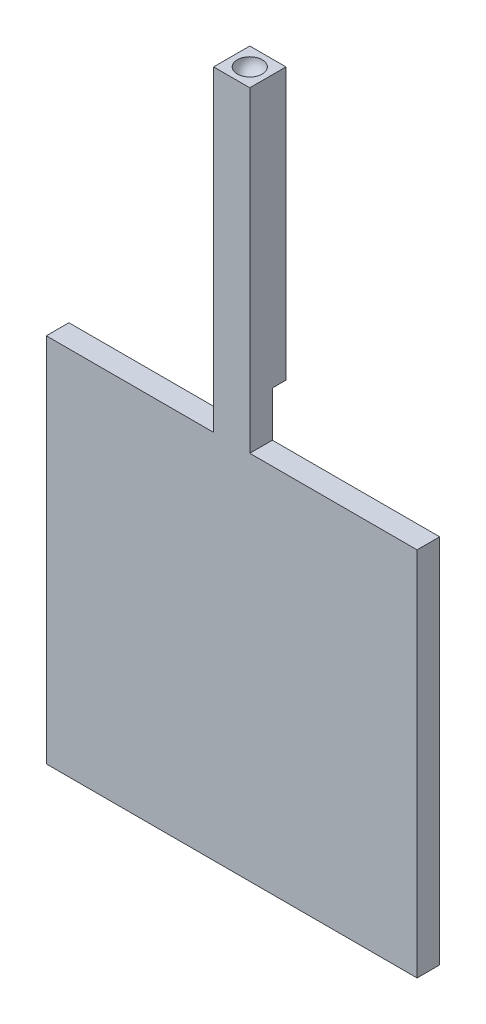
ISO-10303-21;
HEADER;
FILE_DESCRIPTION(('STEP AP214'),'2;1');
FILE_NAME('part.step','',(''),(''),'','','');
FILE_SCHEMA(('AUTOMOTIVE_DESIGN { 1 0 10303 214 1 1 1 1 }'));
ENDSEC;
DATA;
#1=APPLICATION_CONTEXT('core data for automotive mechanical design processes');
#2=APPLICATION_PROTOCOL_DEFINITION('international standard','automotive_design',2000,#1);
#3=PRODUCT_CONTEXT('',#1,'mechanical');
#4=PRODUCT('Part','Part','',(#3));
#5=PRODUCT_RELATED_PRODUCT_CATEGORY('part','',(#4));
#6=PRODUCT_DEFINITION_FORMATION('','',#4);
#7=PRODUCT_DEFINITION_CONTEXT('part definition',#1,'design');
#8=PRODUCT_DEFINITION('design','',#6,#7);
#9=PRODUCT_DEFINITION_SHAPE('','',#8);
#10=(LENGTH_UNIT() NAMED_UNIT(*) SI_UNIT(.MILLI.,.METRE.));
#11=(NAMED_UNIT(*) PLANE_ANGLE_UNIT() SI_UNIT($,.RADIAN.));
#12=(NAMED_UNIT(*) SI_UNIT($,.STERADIAN.) SOLID_ANGLE_UNIT());
#13=UNCERTAINTY_MEASURE_WITH_UNIT(LENGTH_MEASURE(1.E-05),#10,'distance_accuracy_value','');
#14=(GEOMETRIC_REPRESENTATION_CONTEXT(3) GLOBAL_UNCERTAINTY_ASSIGNED_CONTEXT((#13)) GLOBAL_UNIT_ASSIGNED_CONTEXT((#10,
#11,#12)) REPRESENTATION_CONTEXT('',''));
#15=CARTESIAN_POINT('',(0.,0.,0.));
#16=DIRECTION('',(0.,0.,1.));
#17=DIRECTION('',(1.,0.,0.));
#18=AXIS2_PLACEMENT_3D('',#15,#16,#17);
#19=CARTESIAN_POINT('',(0.,0.,0.));
#20=DIRECTION('',(0.,0.,-1.));
#21=DIRECTION('',(-1.,0.,0.));
#22=AXIS2_PLACEMENT_3D('',#19,#20,#21);
#23=PLANE('',#22);
#24=DIRECTION('',(0.,-1.,0.));
#25=VECTOR('',#24,1.);
#26=CARTESIAN_POINT('',(0.,0.,0.));
#27=LINE('',#26,#25);
#28=CARTESIAN_POINT('',(0.,82.,0.));
#29=VERTEX_POINT('',#28);
#30=CARTESIAN_POINT('',(0.,0.,0.));
#31=VERTEX_POINT('',#30);
#32=EDGE_CURVE('E187',#29,#31,#27,.T.);
#33=ORIENTED_EDGE('',*,*,#32,.F.);
#34=DIRECTION('',(-1.,0.,0.));
#35=VECTOR('',#34,1.);
#36=CARTESIAN_POINT('',(0.,82.,0.));
#37=LINE('',#36,#35);
#38=CARTESIAN_POINT('',(37.,82.,0.));
#39=VERTEX_POINT('',#38);
#40=EDGE_CURVE('E206',#39,#29,#37,.T.);
#41=ORIENTED_EDGE('',*,*,#40,.F.);
#42=DIRECTION('',(0.,-1.,0.));
#43=VECTOR('',#42,1.);
#44=CARTESIAN_POINT('',(37.,92.,0.));
#45=LINE('',#44,#43);
#46=CARTESIAN_POINT('',(37.,92.,0.));
#47=VERTEX_POINT('',#46);
#48=EDGE_CURVE('E181',#47,#39,#45,.T.);
#49=ORIENTED_EDGE('',*,*,#48,.F.);
#50=DIRECTION('',(-1.,0.,0.));
#51=VECTOR('',#50,1.);
#52=CARTESIAN_POINT('',(37.,92.,0.));
#53=LINE('',#52,#51);
#54=CARTESIAN_POINT('',(45.,92.,0.));
#55=VERTEX_POINT('',#54);
#56=EDGE_CURVE('E168',#55,#47,#53,.T.);
#57=ORIENTED_EDGE('',*,*,#56,.F.);
#58=DIRECTION('',(0.,-1.,0.));
#59=VECTOR('',#58,1.);
#60=CARTESIAN_POINT('',(45.,92.,0.));
#61=LINE('',#60,#59);
#62=CARTESIAN_POINT('',(45.,82.,0.));
#63=VERTEX_POINT('',#62);
#64=EDGE_CURVE('E184',#55,#63,#61,.T.);
#65=ORIENTED_EDGE('',*,*,#64,.T.);
#66=CARTESIAN_POINT('',(82.,82.,0.));
#67=VERTEX_POINT('',#66);
#68=EDGE_CURVE('E192',#67,#63,#37,.T.);
#69=ORIENTED_EDGE('',*,*,#68,.F.);
#70=DIRECTION('',(0.,1.,0.));
#71=VECTOR('',#70,1.);
#72=CARTESIAN_POINT('',(82.,0.,0.));
#73=LINE('',#72,#71);
#74=CARTESIAN_POINT('',(82.,0.,0.));
#75=VERTEX_POINT('',#74);
#76=EDGE_CURVE('E204',#75,#67,#73,.T.);
#77=ORIENTED_EDGE('',*,*,#76,.F.);
#78=DIRECTION('',(1.,0.,0.));
#79=VECTOR('',#78,1.);
#80=CARTESIAN_POINT('',(0.,0.,0.));
#81=LINE('',#80,#79);
#82=EDGE_CURVE('E202',#31,#75,#81,.T.);
#83=ORIENTED_EDGE('',*,*,#82,.F.);
#84=EDGE_LOOP('',(#33,#41,#49,#57,#65,#69,#77,#83));
#85=FACE_BOUND('',#84,.T.);
#86=DIRECTION('',(-1.,0.,0.));
#87=VECTOR('',#86,1.);
#88=CARTESIAN_POINT('',(37.5,15.,0.));
#89=LINE('',#88,#87);
#90=CARTESIAN_POINT('',(44.5,15.,0.));
#91=VERTEX_POINT('',#90);
#92=CARTESIAN_POINT('',(37.5,15.,0.));
#93=VERTEX_POINT('',#92);
#94=EDGE_CURVE('E48',#91,#93,#89,.T.);
#95=ORIENTED_EDGE('',*,*,#94,.F.);
#96=DIRECTION('',(0.,1.,0.));
#97=VECTOR('',#96,1.);
#98=CARTESIAN_POINT('',(44.5,65.,1.74574066942157E-13));
#99=LINE('',#98,#97);
#100=CARTESIAN_POINT('',(44.5,65.,1.74574066942157E-13));
#101=VERTEX_POINT('',#100);
#102=EDGE_CURVE('E123',#91,#101,#99,.T.);
#103=ORIENTED_EDGE('',*,*,#102,.T.);
#104=DIRECTION('',(-1.,0.,0.));
#105=VECTOR('',#104,1.);
#106=CARTESIAN_POINT('',(37.5,65.,1.74574066942157E-13));
#107=LINE('',#106,#105);
#108=CARTESIAN_POINT('',(37.5,65.,1.74574066942157E-13));
#109=VERTEX_POINT('',#108);
#110=EDGE_CURVE('E129',#101,#109,#107,.T.);
#111=ORIENTED_EDGE('',*,*,#110,.T.);
#112=DIRECTION('',(0.,-1.,0.));
#113=VECTOR('',#112,1.);
#114=CARTESIAN_POINT('',(37.5,65.,1.74574066942157E-13));
#115=LINE('',#114,#113);
#116=EDGE_CURVE('E137',#109,#93,#115,.T.);
#117=ORIENTED_EDGE('',*,*,#116,.T.);
#118=EDGE_LOOP('',(#95,#103,#111,#117));
#119=FACE_BOUND('',#118,.T.);
#120=ADVANCED_FACE('F33',(#85,#119),#23,.T.);
#121=CARTESIAN_POINT('',(0.,82.,5.));
#122=DIRECTION('',(0.,-1.,0.));
#123=DIRECTION('',(0.,0.,-1.));
#124=AXIS2_PLACEMENT_3D('',#121,#122,#123);
#125=PLANE('',#124);
#126=DIRECTION('',(0.,0.,-1.));
#127=VECTOR('',#126,1.);
#128=CARTESIAN_POINT('',(45.,82.,0.));
#129=LINE('',#128,#127);
#130=CARTESIAN_POINT('',(45.,82.,5.));
#131=VERTEX_POINT('',#130);
#132=EDGE_CURVE('E56',#131,#63,#129,.T.);
#133=ORIENTED_EDGE('',*,*,#132,.F.);
#134=DIRECTION('',(-1.,0.,0.));
#135=VECTOR('',#134,1.);
#136=CARTESIAN_POINT('',(0.,82.,5.));
#137=LINE('',#136,#135);
#138=CARTESIAN_POINT('',(82.,82.,5.));
#139=VERTEX_POINT('',#138);
#140=EDGE_CURVE('E197',#139,#131,#137,.T.);
#141=ORIENTED_EDGE('',*,*,#140,.F.);
#142=DIRECTION('',(0.,0.,-1.));
#143=VECTOR('',#142,1.);
#144=CARTESIAN_POINT('',(82.,82.,5.));
#145=LINE('',#144,#143);
#146=EDGE_CURVE('E210',#139,#67,#145,.T.);
#147=ORIENTED_EDGE('',*,*,#146,.T.);
#148=ORIENTED_EDGE('',*,*,#68,.T.);
#149=EDGE_LOOP('',(#133,#141,#147,#148));
#150=FACE_BOUND('',#149,.T.);
#151=ADVANCED_FACE('F224',(#150),#125,.F.);
#152=DIRECTION('',(0.,0.,1.));
#153=VECTOR('',#152,1.);
#154=CARTESIAN_POINT('',(37.,82.,0.));
#155=LINE('',#154,#153);
#156=CARTESIAN_POINT('',(37.,82.,5.));
#157=VERTEX_POINT('',#156);
#158=EDGE_CURVE('E172',#39,#157,#155,.T.);
#159=ORIENTED_EDGE('',*,*,#158,.F.);
#160=ORIENTED_EDGE('',*,*,#40,.T.);
#161=DIRECTION('',(0.,0.,-1.));
#162=VECTOR('',#161,1.);
#163=CARTESIAN_POINT('',(0.,82.,5.));
#164=LINE('',#163,#162);
#165=CARTESIAN_POINT('',(0.,82.,5.));
#166=VERTEX_POINT('',#165);
#167=EDGE_CURVE('E199',#166,#29,#164,.T.);
#168=ORIENTED_EDGE('',*,*,#167,.F.);
#169=EDGE_CURVE('E196',#157,#166,#137,.T.);
#170=ORIENTED_EDGE('',*,*,#169,.F.);
#171=EDGE_LOOP('',(#159,#160,#168,#170));
#172=FACE_BOUND('',#171,.T.);
#173=ADVANCED_FACE('F242',(#172),#125,.F.);
#174=CARTESIAN_POINT('',(0.,0.,5.));
#175=DIRECTION('',(1.,0.,0.));
#176=DIRECTION('',(0.,1.,0.));
#177=AXIS2_PLACEMENT_3D('',#174,#175,#176);
#178=PLANE('',#177);
#179=ORIENTED_EDGE('',*,*,#32,.T.);
#180=DIRECTION('',(0.,0.,-1.));
#181=VECTOR('',#180,1.);
#182=CARTESIAN_POINT('',(0.,0.,5.));
#183=LINE('',#182,#181);
#184=CARTESIAN_POINT('',(0.,0.,5.));
#185=VERTEX_POINT('',#184);
#186=EDGE_CURVE('E11',#185,#31,#183,.T.);
#187=ORIENTED_EDGE('',*,*,#186,.F.);
#188=DIRECTION('',(0.,-1.,0.));
#189=VECTOR('',#188,1.);
#190=CARTESIAN_POINT('',(0.,0.,5.));
#191=LINE('',#190,#189);
#192=EDGE_CURVE('E188',#166,#185,#191,.T.);
#193=ORIENTED_EDGE('',*,*,#192,.F.);
#194=ORIENTED_EDGE('',*,*,#167,.T.);
#195=EDGE_LOOP('',(#179,#187,#193,#194));
#196=FACE_BOUND('',#195,.T.);
#197=ADVANCED_FACE('F35',(#196),#178,.F.);
#198=CARTESIAN_POINT('',(0.,0.,5.));
#199=DIRECTION('',(0.,1.,0.));
#200=DIRECTION('',(0.,0.,1.));
#201=AXIS2_PLACEMENT_3D('',#198,#199,#200);
#202=PLANE('',#201);
#203=ORIENTED_EDGE('',*,*,#82,.T.);
#204=DIRECTION('',(0.,0.,-1.));
#205=VECTOR('',#204,1.);
#206=CARTESIAN_POINT('',(82.,0.,5.));
#207=LINE('',#206,#205);
#208=CARTESIAN_POINT('',(82.,0.,5.));
#209=VERTEX_POINT('',#208);
#210=EDGE_CURVE('E41',#209,#75,#207,.T.);
#211=ORIENTED_EDGE('',*,*,#210,.F.);
#212=DIRECTION('',(1.,0.,0.));
#213=VECTOR('',#212,1.);
#214=CARTESIAN_POINT('',(0.,0.,5.));
#215=LINE('',#214,#213);
#216=EDGE_CURVE('E191',#185,#209,#215,.T.);
#217=ORIENTED_EDGE('',*,*,#216,.F.);
#218=ORIENTED_EDGE('',*,*,#186,.T.);
#219=EDGE_LOOP('',(#203,#211,#217,#218));
#220=FACE_BOUND('',#219,.T.);
#221=ADVANCED_FACE('F246',(#220),#202,.F.);
#222=CARTESIAN_POINT('',(82.,0.,5.));
#223=DIRECTION('',(-1.,0.,0.));
#224=DIRECTION('',(0.,-1.,0.));
#225=AXIS2_PLACEMENT_3D('',#222,#223,#224);
#226=PLANE('',#225);
#227=ORIENTED_EDGE('',*,*,#76,.T.);
#228=ORIENTED_EDGE('',*,*,#146,.F.);
#229=DIRECTION('',(0.,1.,0.));
#230=VECTOR('',#229,1.);
#231=CARTESIAN_POINT('',(82.,0.,5.));
#232=LINE('',#231,#230);
#233=EDGE_CURVE('E194',#209,#139,#232,.T.);
#234=ORIENTED_EDGE('',*,*,#233,.F.);
#235=ORIENTED_EDGE('',*,*,#210,.T.);
#236=EDGE_LOOP('',(#227,#228,#234,#235));
#237=FACE_BOUND('',#236,.T.);
#238=ADVANCED_FACE('F217',(#237),#226,.F.);
#239=CARTESIAN_POINT('',(0.,0.,5.));
#240=DIRECTION('',(0.,0.,-1.));
#241=DIRECTION('',(-1.,0.,0.));
#242=AXIS2_PLACEMENT_3D('',#239,#240,#241);
#243=PLANE('',#242);
#244=ORIENTED_EDGE('',*,*,#192,.T.);
#245=ORIENTED_EDGE('',*,*,#216,.T.);
#246=ORIENTED_EDGE('',*,*,#233,.T.);
#247=ORIENTED_EDGE('',*,*,#140,.T.);
#248=DIRECTION('',(0.,-1.,0.));
#249=VECTOR('',#248,1.);
#250=CARTESIAN_POINT('',(45.,92.,5.));
#251=LINE('',#250,#249);
#252=CARTESIAN_POINT('',(45.,152.,5.));
#253=VERTEX_POINT('',#252);
#254=EDGE_CURVE('E171',#253,#131,#251,.T.);
#255=ORIENTED_EDGE('',*,*,#254,.F.);
#256=DIRECTION('',(1.,0.,0.));
#257=VECTOR('',#256,1.);
#258=CARTESIAN_POINT('',(45.,152.,5.));
#259=LINE('',#258,#257);
#260=CARTESIAN_POINT('',(37.,152.,5.));
#261=VERTEX_POINT('',#260);
#262=EDGE_CURVE('E149',#261,#253,#259,.T.);
#263=ORIENTED_EDGE('',*,*,#262,.F.);
#264=DIRECTION('',(0.,-1.,0.));
#265=VECTOR('',#264,1.);
#266=CARTESIAN_POINT('',(37.,92.,5.));
#267=LINE('',#266,#265);
#268=EDGE_CURVE('E178',#261,#157,#267,.T.);
#269=ORIENTED_EDGE('',*,*,#268,.T.);
#270=ORIENTED_EDGE('',*,*,#169,.T.);
#271=EDGE_LOOP('',(#244,#245,#246,#247,#255,#263,#269,#270));
#272=FACE_BOUND('',#271,.T.);
#273=ADVANCED_FACE('F226',(#272),#243,.F.);
#274=CARTESIAN_POINT('',(45.,92.,0.));
#275=DIRECTION('',(-1.,0.,0.));
#276=DIRECTION('',(0.,0.,1.));
#277=AXIS2_PLACEMENT_3D('',#274,#275,#276);
#278=PLANE('',#277);
#279=ORIENTED_EDGE('',*,*,#132,.T.);
#280=ORIENTED_EDGE('',*,*,#64,.F.);
#281=DIRECTION('',(0.,0.,-1.));
#282=VECTOR('',#281,1.);
#283=CARTESIAN_POINT('',(45.,92.,-3.));
#284=LINE('',#283,#282);
#285=CARTESIAN_POINT('',(45.,92.,-3.));
#286=VERTEX_POINT('',#285);
#287=EDGE_CURVE('E160',#55,#286,#284,.T.);
#288=ORIENTED_EDGE('',*,*,#287,.T.);
#289=DIRECTION('',(0.,-1.,0.));
#290=VECTOR('',#289,1.);
#291=CARTESIAN_POINT('',(45.,152.,-3.));
#292=LINE('',#291,#290);
#293=CARTESIAN_POINT('',(45.,152.,-3.));
#294=VERTEX_POINT('',#293);
#295=EDGE_CURVE('E165',#294,#286,#292,.T.);
#296=ORIENTED_EDGE('',*,*,#295,.F.);
#297=DIRECTION('',(0.,0.,-1.));
#298=VECTOR('',#297,1.);
#299=CARTESIAN_POINT('',(45.,152.,-3.));
#300=LINE('',#299,#298);
#301=EDGE_CURVE('E153',#253,#294,#300,.T.);
#302=ORIENTED_EDGE('',*,*,#301,.F.);
#303=ORIENTED_EDGE('',*,*,#254,.T.);
#304=EDGE_LOOP('',(#279,#280,#288,#296,#302,#303));
#305=FACE_BOUND('',#304,.T.);
#306=ADVANCED_FACE('F230',(#305),#278,.F.);
#307=CARTESIAN_POINT('',(37.,92.,0.));
#308=DIRECTION('',(1.,0.,0.));
#309=DIRECTION('',(0.,0.,-1.));
#310=AXIS2_PLACEMENT_3D('',#307,#308,#309);
#311=PLANE('',#310);
#312=ORIENTED_EDGE('',*,*,#158,.T.);
#313=ORIENTED_EDGE('',*,*,#268,.F.);
#314=DIRECTION('',(0.,0.,1.));
#315=VECTOR('',#314,1.);
#316=CARTESIAN_POINT('',(37.,152.,-3.));
#317=LINE('',#316,#315);
#318=CARTESIAN_POINT('',(37.,152.,-3.));
#319=VERTEX_POINT('',#318);
#320=EDGE_CURVE('E146',#319,#261,#317,.T.);
#321=ORIENTED_EDGE('',*,*,#320,.F.);
#322=DIRECTION('',(0.,-1.,0.));
#323=VECTOR('',#322,1.);
#324=CARTESIAN_POINT('',(37.,152.,-3.));
#325=LINE('',#324,#323);
#326=CARTESIAN_POINT('',(37.,92.,-3.));
#327=VERTEX_POINT('',#326);
#328=EDGE_CURVE('E157',#319,#327,#325,.T.);
#329=ORIENTED_EDGE('',*,*,#328,.T.);
#330=DIRECTION('',(0.,0.,1.));
#331=VECTOR('',#330,1.);
#332=CARTESIAN_POINT('',(37.,92.,-3.));
#333=LINE('',#332,#331);
#334=EDGE_CURVE('E145',#327,#47,#333,.T.);
#335=ORIENTED_EDGE('',*,*,#334,.T.);
#336=ORIENTED_EDGE('',*,*,#48,.T.);
#337=EDGE_LOOP('',(#312,#313,#321,#329,#335,#336));
#338=FACE_BOUND('',#337,.T.);
#339=ADVANCED_FACE('F239',(#338),#311,.F.);
#340=CARTESIAN_POINT('',(45.,152.,-3.));
#341=DIRECTION('',(0.,0.,1.));
#342=DIRECTION('',(1.,0.,0.));
#343=AXIS2_PLACEMENT_3D('',#340,#341,#342);
#344=PLANE('',#343);
#345=DIRECTION('',(-1.,0.,0.));
#346=VECTOR('',#345,1.);
#347=CARTESIAN_POINT('',(45.,92.,-3.));
#348=LINE('',#347,#346);
#349=EDGE_CURVE('E150',#286,#327,#348,.T.);
#350=ORIENTED_EDGE('',*,*,#349,.T.);
#351=ORIENTED_EDGE('',*,*,#328,.F.);
#352=DIRECTION('',(-1.,0.,0.));
#353=VECTOR('',#352,1.);
#354=CARTESIAN_POINT('',(45.,152.,-3.));
#355=LINE('',#354,#353);
#356=EDGE_CURVE('E155',#294,#319,#355,.T.);
#357=ORIENTED_EDGE('',*,*,#356,.F.);
#358=ORIENTED_EDGE('',*,*,#295,.T.);
#359=EDGE_LOOP('',(#350,#351,#357,#358));
#360=FACE_BOUND('',#359,.T.);
#361=ADVANCED_FACE('F266',(#360),#344,.F.);
#362=CARTESIAN_POINT('',(0.,152.,0.));
#363=DIRECTION('',(0.,-1.,0.));
#364=DIRECTION('',(0.,0.,-1.));
#365=AXIS2_PLACEMENT_3D('',#362,#363,#364);
#366=PLANE('',#365);
#367=CARTESIAN_POINT('',(41.,152.,1.));
#368=DIRECTION('',(0.,-1.,0.));
#369=DIRECTION('',(0.,0.,1.));
#370=AXIS2_PLACEMENT_3D('',#367,#368,#369);
#371=CIRCLE('',#370,2.75);
#372=CARTESIAN_POINT('',(41.,152.,3.75));
#373=VERTEX_POINT('',#372);
#374=EDGE_CURVE('E132',#373,#373,#371,.T.);
#375=ORIENTED_EDGE('',*,*,#374,.T.);
#376=EDGE_LOOP('',(#375));
#377=FACE_BOUND('',#376,.T.);
#378=ORIENTED_EDGE('',*,*,#320,.T.);
#379=ORIENTED_EDGE('',*,*,#262,.T.);
#380=ORIENTED_EDGE('',*,*,#301,.T.);
#381=ORIENTED_EDGE('',*,*,#356,.T.);
#382=EDGE_LOOP('',(#378,#379,#380,#381));
#383=FACE_BOUND('',#382,.T.);
#384=ADVANCED_FACE('F234',(#377,#383),#366,.F.);
#385=CARTESIAN_POINT('',(0.,92.,0.));
#386=DIRECTION('',(0.,-1.,0.));
#387=DIRECTION('',(0.,0.,-1.));
#388=AXIS2_PLACEMENT_3D('',#385,#386,#387);
#389=PLANE('',#388);
#390=ORIENTED_EDGE('',*,*,#287,.F.);
#391=ORIENTED_EDGE('',*,*,#56,.T.);
#392=ORIENTED_EDGE('',*,*,#334,.F.);
#393=ORIENTED_EDGE('',*,*,#349,.F.);
#394=EDGE_LOOP('',(#390,#391,#392,#393));
#395=FACE_BOUND('',#394,.T.);
#396=ADVANCED_FACE('F270',(#395),#389,.T.);
#397=CARTESIAN_POINT('',(41.,152.,1.));
#398=DIRECTION('',(-1.,0.,0.));
#399=DIRECTION('',(0.,0.,1.));
#400=AXIS2_PLACEMENT_3D('',#397,#398,#399);
#401=SPHERICAL_SURFACE('',#400,2.75);
#402=CARTESIAN_POINT('',(41.,152.,1.));
#403=DIRECTION('',(0.,-1.,0.));
#404=DIRECTION('',(0.,0.,1.));
#405=AXIS2_PLACEMENT_3D('',#402,#403,#404);
#406=SPHERICAL_SURFACE('',#405,2.75);
#407=ORIENTED_EDGE('',*,*,#374,.F.);
#408=EDGE_LOOP('',(#407));
#409=FACE_BOUND('',#408,.T.);
#410=ADVANCED_FACE('F273',(#409),#406,.F.);
#411=CARTESIAN_POINT('',(44.5,65.,1.74574066942157E-13));
#412=DIRECTION('',(-1.,0.,0.));
#413=DIRECTION('',(0.,0.,1.));
#414=AXIS2_PLACEMENT_3D('',#411,#412,#413);
#415=PLANE('',#414);
#416=CARTESIAN_POINT('',(44.5,40.,0.));
#417=DIRECTION('',(-1.,0.,0.));
#418=DIRECTION('',(0.,0.,1.));
#419=AXIS2_PLACEMENT_3D('',#416,#417,#418);
#420=CIRCLE('',#419,25.);
#421=EDGE_CURVE('E125',#101,#91,#420,.T.);
#422=ORIENTED_EDGE('',*,*,#421,.F.);
#423=ORIENTED_EDGE('',*,*,#102,.F.);
#424=EDGE_LOOP('',(#422,#423));
#425=FACE_BOUND('',#424,.T.);
#426=ADVANCED_FACE('F124',(#425),#415,.F.);
#427=CARTESIAN_POINT('',(37.5,40.,0.));
#428=DIRECTION('',(-1.,0.,0.));
#429=DIRECTION('',(0.,0.,1.));
#430=AXIS2_PLACEMENT_3D('',#427,#428,#429);
#431=CYLINDRICAL_SURFACE('',#430,25.);
#432=CARTESIAN_POINT('',(37.5,40.,0.));
#433=DIRECTION('',(-1.,0.,0.));
#434=DIRECTION('',(0.,0.,1.));
#435=AXIS2_PLACEMENT_3D('',#432,#433,#434);
#436=CIRCLE('',#435,25.);
#437=EDGE_CURVE('E133',#109,#93,#436,.T.);
#438=ORIENTED_EDGE('',*,*,#437,.F.);
#439=ORIENTED_EDGE('',*,*,#110,.F.);
#440=ORIENTED_EDGE('',*,*,#421,.T.);
#441=ORIENTED_EDGE('',*,*,#94,.T.);
#442=EDGE_LOOP('',(#438,#439,#440,#441));
#443=FACE_BOUND('',#442,.T.);
#444=ADVANCED_FACE('F131',(#443),#431,.T.);
#445=CARTESIAN_POINT('',(37.5,65.,1.74574066942157E-13));
#446=DIRECTION('',(1.,0.,0.));
#447=DIRECTION('',(0.,0.,-1.));
#448=AXIS2_PLACEMENT_3D('',#445,#446,#447);
#449=PLANE('',#448);
#450=ORIENTED_EDGE('',*,*,#437,.T.);
#451=ORIENTED_EDGE('',*,*,#116,.F.);
#452=EDGE_LOOP('',(#450,#451));
#453=FACE_BOUND('',#452,.T.);
#454=ADVANCED_FACE('F283',(#453),#449,.F.);
#455=CLOSED_SHELL('',(#120,#151,#173,#197,#221,#238,#273,#306,#339,#361,#384,#396,#410,#426,
#444,#454));
#456=MANIFOLD_SOLID_BREP('B2',#455);
#457=ADVANCED_BREP_SHAPE_REPRESENTATION('',(#18,#456),#14);
#458=SHAPE_DEFINITION_REPRESENTATION(#9,#457);
ENDSEC;
END-ISO-10303-21;
